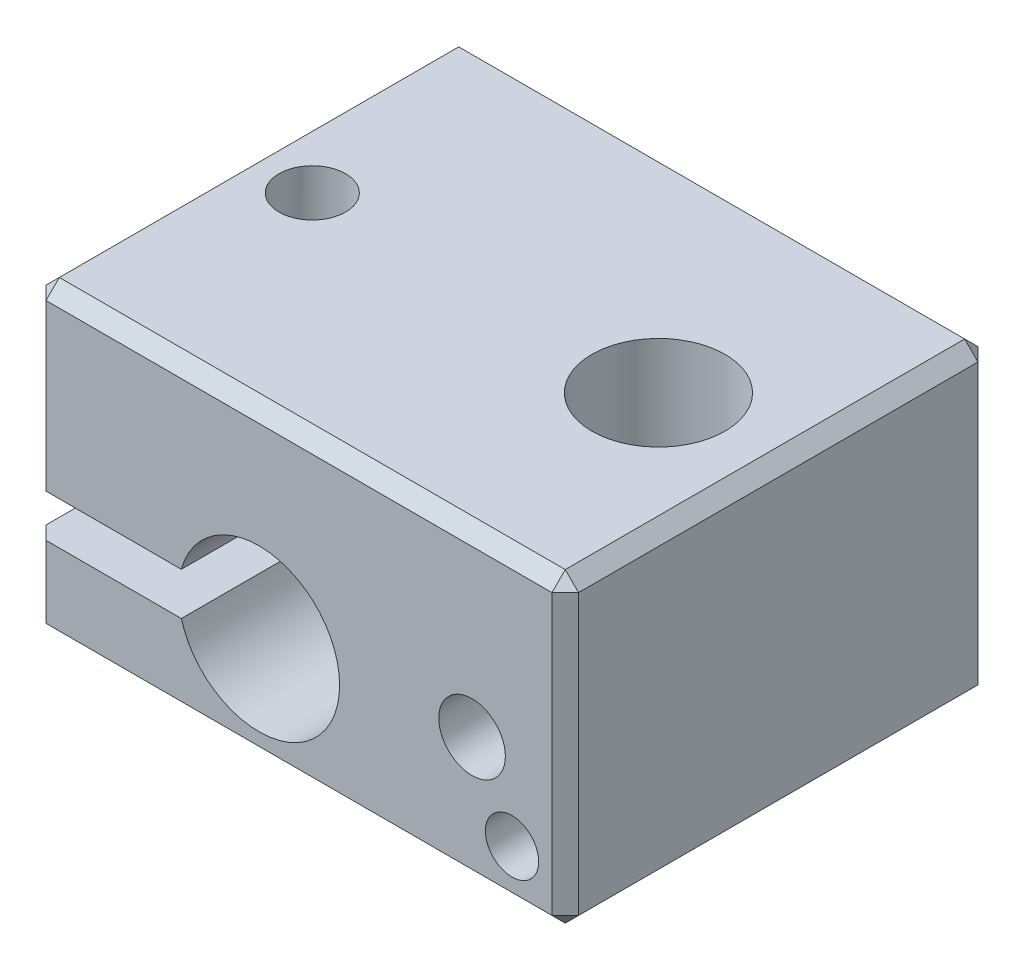
ISO-10303-21;
HEADER;
FILE_DESCRIPTION(('STEP AP214'),'2;1');
FILE_NAME('part.step','',(''),(''),'','','');
FILE_SCHEMA(('AUTOMOTIVE_DESIGN { 1 0 10303 214 1 1 1 1 }'));
ENDSEC;
DATA;
#1=APPLICATION_CONTEXT('core data for automotive mechanical design processes');
#2=APPLICATION_PROTOCOL_DEFINITION('international standard','automotive_design',2000,#1);
#3=PRODUCT_CONTEXT('',#1,'mechanical');
#4=PRODUCT('Part','Part','',(#3));
#5=PRODUCT_RELATED_PRODUCT_CATEGORY('part','',(#4));
#6=PRODUCT_DEFINITION_FORMATION('','',#4);
#7=PRODUCT_DEFINITION_CONTEXT('part definition',#1,'design');
#8=PRODUCT_DEFINITION('design','',#6,#7);
#9=PRODUCT_DEFINITION_SHAPE('','',#8);
#10=(LENGTH_UNIT() NAMED_UNIT(*) SI_UNIT(.MILLI.,.METRE.));
#11=(NAMED_UNIT(*) PLANE_ANGLE_UNIT() SI_UNIT($,.RADIAN.));
#12=(NAMED_UNIT(*) SI_UNIT($,.STERADIAN.) SOLID_ANGLE_UNIT());
#13=UNCERTAINTY_MEASURE_WITH_UNIT(LENGTH_MEASURE(1.E-05),#10,'distance_accuracy_value','');
#14=(GEOMETRIC_REPRESENTATION_CONTEXT(3) GLOBAL_UNCERTAINTY_ASSIGNED_CONTEXT((#13)) GLOBAL_UNIT_ASSIGNED_CONTEXT((#10,
#11,#12)) REPRESENTATION_CONTEXT('',''));
#15=CARTESIAN_POINT('',(0.,0.,0.));
#16=DIRECTION('',(0.,0.,1.));
#17=DIRECTION('',(1.,0.,0.));
#18=AXIS2_PLACEMENT_3D('',#15,#16,#17);
#19=CARTESIAN_POINT('',(-107.580280401954,-72.9503333027545,16.));
#20=DIRECTION('',(1.,0.,0.));
#21=DIRECTION('',(0.,1.,0.));
#22=AXIS2_PLACEMENT_3D('',#19,#20,#21);
#23=PLANE('',#22);
#24=DIRECTION('',(0.,0.,-1.));
#25=VECTOR('',#24,1.);
#26=CARTESIAN_POINT('',(-107.580280401954,-79.6503333027545,16.));
#27=LINE('',#26,#25);
#28=CARTESIAN_POINT('',(-107.580280401954,-79.6503333027545,15.5));
#29=VERTEX_POINT('',#28);
#30=CARTESIAN_POINT('',(-107.580280401954,-79.6503333027545,0.500000000000005));
#31=VERTEX_POINT('',#30);
#32=EDGE_CURVE('E206',#29,#31,#27,.T.);
#33=ORIENTED_EDGE('',*,*,#32,.F.);
#34=DIRECTION('',(0.,1.,0.));
#35=VECTOR('',#34,1.);
#36=CARTESIAN_POINT('',(-107.580280401954,-72.9503333027545,15.5));
#37=LINE('',#36,#35);
#38=CARTESIAN_POINT('',(-107.580280401954,-73.4503333027545,15.5));
#39=VERTEX_POINT('',#38);
#40=EDGE_CURVE('E214',#29,#39,#37,.T.);
#41=ORIENTED_EDGE('',*,*,#40,.T.);
#42=DIRECTION('',(0.,0.,-1.));
#43=VECTOR('',#42,1.);
#44=CARTESIAN_POINT('',(-107.580280401954,-73.4503333027545,16.));
#45=LINE('',#44,#43);
#46=CARTESIAN_POINT('',(-107.580280401954,-73.4503333027545,0.5));
#47=VERTEX_POINT('',#46);
#48=EDGE_CURVE('E211',#39,#47,#45,.T.);
#49=ORIENTED_EDGE('',*,*,#48,.T.);
#50=DIRECTION('',(0.,-1.,0.));
#51=VECTOR('',#50,1.);
#52=CARTESIAN_POINT('',(-107.580280401954,-72.9503333027545,0.5));
#53=LINE('',#52,#51);
#54=EDGE_CURVE('E209',#47,#31,#53,.T.);
#55=ORIENTED_EDGE('',*,*,#54,.T.);
#56=EDGE_LOOP('',(#33,#41,#49,#55));
#57=FACE_BOUND('',#56,.T.);
#58=ADVANCED_FACE('F37',(#57),#23,.F.);
#59=CARTESIAN_POINT('',(-107.580280401954,-79.6503333027545,16.));
#60=DIRECTION('',(0.,1.,0.));
#61=DIRECTION('',(-1.,0.,0.));
#62=AXIS2_PLACEMENT_3D('',#59,#60,#61);
#63=PLANE('',#62);
#64=CARTESIAN_POINT('',(-105.080280401954,-79.6503333027545,8.));
#65=DIRECTION('',(0.,1.,0.));
#66=DIRECTION('',(-1.,0.,0.));
#67=AXIS2_PLACEMENT_3D('',#64,#65,#66);
#68=CIRCLE('',#67,1.25);
#69=CARTESIAN_POINT('',(-106.330280401954,-79.6503333027545,8.));
#70=VERTEX_POINT('',#69);
#71=EDGE_CURVE('E356',#70,#70,#68,.T.);
#72=ORIENTED_EDGE('',*,*,#71,.T.);
#73=EDGE_LOOP('',(#72));
#74=FACE_BOUND('',#73,.T.);
#75=DIRECTION('',(1.,0.,0.));
#76=VECTOR('',#75,1.);
#77=CARTESIAN_POINT('',(-107.580280401954,-79.6503333027545,16.));
#78=LINE('',#77,#76);
#79=CARTESIAN_POINT('',(-107.080280401954,-79.6503333027545,16.));
#80=VERTEX_POINT('',#79);
#81=CARTESIAN_POINT('',(-101.99757795277,-79.6503333027545,16.));
#82=VERTEX_POINT('',#81);
#83=EDGE_CURVE('E186',#80,#82,#78,.T.);
#84=ORIENTED_EDGE('',*,*,#83,.F.);
#85=DIRECTION('',(-0.707106781186541,0.,-0.707106781186554));
#86=VECTOR('',#85,1.);
#87=CARTESIAN_POINT('',(-107.080280401954,-79.6503333027545,16.));
#88=LINE('',#87,#86);
#89=EDGE_CURVE('E247',#80,#29,#88,.T.);
#90=ORIENTED_EDGE('',*,*,#89,.T.);
#91=ORIENTED_EDGE('',*,*,#32,.T.);
#92=DIRECTION('',(-0.707106781186539,0.,0.707106781186556));
#93=VECTOR('',#92,1.);
#94=CARTESIAN_POINT('',(-107.580280401954,-79.6503333027545,0.500000000000002));
#95=LINE('',#94,#93);
#96=CARTESIAN_POINT('',(-107.080280401954,-79.6503333027545,0.));
#97=VERTEX_POINT('',#96);
#98=EDGE_CURVE('E245',#31,#97,#95,.F.);
#99=ORIENTED_EDGE('',*,*,#98,.T.);
#100=DIRECTION('',(1.,0.,0.));
#101=VECTOR('',#100,1.);
#102=CARTESIAN_POINT('',(-107.580280401954,-79.6503333027545,0.));
#103=LINE('',#102,#101);
#104=CARTESIAN_POINT('',(-101.99757795277,-79.6503333027545,0.));
#105=VERTEX_POINT('',#104);
#106=EDGE_CURVE('E176',#97,#105,#103,.T.);
#107=ORIENTED_EDGE('',*,*,#106,.T.);
#108=DIRECTION('',(0.,0.,-1.));
#109=VECTOR('',#108,1.);
#110=CARTESIAN_POINT('',(-101.99757795277,-79.6503333027545,16.));
#111=LINE('',#110,#109);
#112=EDGE_CURVE('E203',#82,#105,#111,.T.);
#113=ORIENTED_EDGE('',*,*,#112,.F.);
#114=EDGE_LOOP('',(#84,#90,#91,#99,#107,#113));
#115=FACE_BOUND('',#114,.T.);
#116=ADVANCED_FACE('F383',(#74,#115),#63,.F.);
#117=CARTESIAN_POINT('',(-99.0802804019537,-80.4503333027545,16.));
#118=DIRECTION('',(0.,0.,-1.));
#119=DIRECTION('',(-1.,0.,0.));
#120=AXIS2_PLACEMENT_3D('',#117,#118,#119);
#121=CYLINDRICAL_SURFACE('',#120,3.02499999999999);
#122=CARTESIAN_POINT('',(-99.0802804019537,-80.4503333027545,0.));
#123=DIRECTION('',(0.,0.,-1.));
#124=DIRECTION('',(1.,0.,0.));
#125=AXIS2_PLACEMENT_3D('',#122,#123,#124);
#126=CIRCLE('',#125,3.02499999999999);
#127=CARTESIAN_POINT('',(-101.99757795277,-81.2503333027545,0.));
#128=VERTEX_POINT('',#127);
#129=EDGE_CURVE('E179',#105,#128,#126,.T.);
#130=ORIENTED_EDGE('',*,*,#129,.T.);
#131=DIRECTION('',(0.,0.,-1.));
#132=VECTOR('',#131,1.);
#133=CARTESIAN_POINT('',(-101.99757795277,-81.2503333027545,16.));
#134=LINE('',#133,#132);
#135=CARTESIAN_POINT('',(-101.99757795277,-81.2503333027545,16.));
#136=VERTEX_POINT('',#135);
#137=EDGE_CURVE('E200',#136,#128,#134,.T.);
#138=ORIENTED_EDGE('',*,*,#137,.F.);
#139=CARTESIAN_POINT('',(-99.0802804019537,-80.4503333027545,16.));
#140=DIRECTION('',(0.,0.,-1.));
#141=DIRECTION('',(1.,0.,0.));
#142=AXIS2_PLACEMENT_3D('',#139,#140,#141);
#143=CIRCLE('',#142,3.02499999999999);
#144=EDGE_CURVE('E188',#82,#136,#143,.T.);
#145=ORIENTED_EDGE('',*,*,#144,.F.);
#146=ORIENTED_EDGE('',*,*,#112,.T.);
#147=EDGE_LOOP('',(#130,#138,#145,#146));
#148=FACE_BOUND('',#147,.T.);
#149=ADVANCED_FACE('F389',(#148),#121,.F.);
#150=CARTESIAN_POINT('',(-107.580280401954,-81.2503333027545,16.));
#151=DIRECTION('',(0.,-1.,0.));
#152=DIRECTION('',(1.,0.,0.));
#153=AXIS2_PLACEMENT_3D('',#150,#151,#152);
#154=PLANE('',#153);
#155=CARTESIAN_POINT('',(-105.080280401954,-81.2503333027545,8.));
#156=DIRECTION('',(0.,-1.,0.));
#157=DIRECTION('',(1.,0.,0.));
#158=AXIS2_PLACEMENT_3D('',#155,#156,#157);
#159=CIRCLE('',#158,1.6);
#160=CARTESIAN_POINT('',(-103.480280401954,-81.2503333027545,8.));
#161=VERTEX_POINT('',#160);
#162=EDGE_CURVE('E580',#161,#161,#159,.T.);
#163=ORIENTED_EDGE('',*,*,#162,.T.);
#164=EDGE_LOOP('',(#163));
#165=FACE_BOUND('',#164,.T.);
#166=DIRECTION('',(0.,0.,-1.));
#167=VECTOR('',#166,1.);
#168=CARTESIAN_POINT('',(-107.580280401954,-81.2503333027545,16.));
#169=LINE('',#168,#167);
#170=CARTESIAN_POINT('',(-107.580280401954,-81.2503333027545,15.5));
#171=VERTEX_POINT('',#170);
#172=CARTESIAN_POINT('',(-107.580280401954,-81.2503333027545,0.500000000000006));
#173=VERTEX_POINT('',#172);
#174=EDGE_CURVE('E193',#171,#173,#169,.T.);
#175=ORIENTED_EDGE('',*,*,#174,.F.);
#176=DIRECTION('',(0.70710678118655,0.,0.707106781186545));
#177=VECTOR('',#176,1.);
#178=CARTESIAN_POINT('',(-107.080280401954,-81.2503333027545,16.));
#179=LINE('',#178,#177);
#180=CARTESIAN_POINT('',(-107.080280401954,-81.2503333027545,16.));
#181=VERTEX_POINT('',#180);
#182=EDGE_CURVE('E243',#171,#181,#179,.T.);
#183=ORIENTED_EDGE('',*,*,#182,.T.);
#184=DIRECTION('',(-1.,0.,0.));
#185=VECTOR('',#184,1.);
#186=CARTESIAN_POINT('',(-107.580280401954,-81.2503333027545,16.));
#187=LINE('',#186,#185);
#188=EDGE_CURVE('E191',#136,#181,#187,.T.);
#189=ORIENTED_EDGE('',*,*,#188,.F.);
#190=ORIENTED_EDGE('',*,*,#137,.T.);
#191=DIRECTION('',(-1.,0.,0.));
#192=VECTOR('',#191,1.);
#193=CARTESIAN_POINT('',(-107.580280401954,-81.2503333027545,0.));
#194=LINE('',#193,#192);
#195=CARTESIAN_POINT('',(-107.080280401954,-81.2503333027545,0.));
#196=VERTEX_POINT('',#195);
#197=EDGE_CURVE('E189',#128,#196,#194,.T.);
#198=ORIENTED_EDGE('',*,*,#197,.T.);
#199=DIRECTION('',(0.707106781186548,0.,-0.707106781186548));
#200=VECTOR('',#199,1.);
#201=CARTESIAN_POINT('',(-107.580280401954,-81.2503333027545,0.5));
#202=LINE('',#201,#200);
#203=EDGE_CURVE('E241',#196,#173,#202,.F.);
#204=ORIENTED_EDGE('',*,*,#203,.T.);
#205=EDGE_LOOP('',(#175,#183,#189,#190,#198,#204));
#206=FACE_BOUND('',#205,.T.);
#207=ADVANCED_FACE('F487',(#165,#206),#154,.F.);
#208=CARTESIAN_POINT('',(-107.580280401954,-81.2503333027545,16.));
#209=DIRECTION('',(1.,0.,0.));
#210=DIRECTION('',(0.,0.,-1.));
#211=AXIS2_PLACEMENT_3D('',#208,#209,#210);
#212=PLANE('',#211);
#213=DIRECTION('',(0.,0.,1.));
#214=VECTOR('',#213,1.);
#215=CARTESIAN_POINT('',(-107.580280401954,-83.9503333027545,16.));
#216=LINE('',#215,#214);
#217=CARTESIAN_POINT('',(-107.580280401954,-83.9503333027545,0.5));
#218=VERTEX_POINT('',#217);
#219=CARTESIAN_POINT('',(-107.580280401954,-83.9503333027545,15.5));
#220=VERTEX_POINT('',#219);
#221=EDGE_CURVE('E237',#218,#220,#216,.T.);
#222=ORIENTED_EDGE('',*,*,#221,.T.);
#223=DIRECTION('',(0.,1.,0.));
#224=VECTOR('',#223,1.);
#225=CARTESIAN_POINT('',(-107.580280401954,-81.2503333027545,15.5));
#226=LINE('',#225,#224);
#227=EDGE_CURVE('E239',#220,#171,#226,.T.);
#228=ORIENTED_EDGE('',*,*,#227,.T.);
#229=ORIENTED_EDGE('',*,*,#174,.T.);
#230=DIRECTION('',(0.,-1.,0.));
#231=VECTOR('',#230,1.);
#232=CARTESIAN_POINT('',(-107.580280401954,-81.2503333027545,0.5));
#233=LINE('',#232,#231);
#234=EDGE_CURVE('E235',#173,#218,#233,.T.);
#235=ORIENTED_EDGE('',*,*,#234,.T.);
#236=EDGE_LOOP('',(#222,#228,#229,#235));
#237=FACE_BOUND('',#236,.T.);
#238=ADVANCED_FACE('F491',(#237),#212,.F.);
#239=CARTESIAN_POINT('',(-107.580280401954,-84.4503333027545,16.));
#240=DIRECTION('',(0.,1.,0.));
#241=DIRECTION('',(0.,0.,1.));
#242=AXIS2_PLACEMENT_3D('',#239,#240,#241);
#243=PLANE('',#242);
#244=CARTESIAN_POINT('',(-105.080280401954,-84.4503333027545,8.));
#245=DIRECTION('',(0.,-1.,0.));
#246=DIRECTION('',(0.,0.,-1.));
#247=AXIS2_PLACEMENT_3D('',#244,#245,#246);
#248=CIRCLE('',#247,1.6);
#249=CARTESIAN_POINT('',(-105.080280401954,-84.4503333027545,6.4));
#250=VERTEX_POINT('',#249);
#251=EDGE_CURVE('E583',#250,#250,#248,.T.);
#252=ORIENTED_EDGE('',*,*,#251,.F.);
#253=EDGE_LOOP('',(#252));
#254=FACE_BOUND('',#253,.T.);
#255=DIRECTION('',(-1.,0.,0.));
#256=VECTOR('',#255,1.);
#257=CARTESIAN_POINT('',(-107.580280401954,-84.4503333027545,15.5));
#258=LINE('',#257,#256);
#259=CARTESIAN_POINT('',(-88.0802804019537,-84.4503333027545,15.5));
#260=VERTEX_POINT('',#259);
#261=CARTESIAN_POINT('',(-107.080280401954,-84.4503333027545,15.5));
#262=VERTEX_POINT('',#261);
#263=EDGE_CURVE('E249',#260,#262,#258,.T.);
#264=ORIENTED_EDGE('',*,*,#263,.T.);
#265=DIRECTION('',(0.,0.,-1.));
#266=VECTOR('',#265,1.);
#267=CARTESIAN_POINT('',(-107.080280401954,-84.4503333027545,16.));
#268=LINE('',#267,#266);
#269=CARTESIAN_POINT('',(-107.080280401954,-84.4503333027545,0.5));
#270=VERTEX_POINT('',#269);
#271=EDGE_CURVE('E255',#262,#270,#268,.T.);
#272=ORIENTED_EDGE('',*,*,#271,.T.);
#273=DIRECTION('',(1.,0.,0.));
#274=VECTOR('',#273,1.);
#275=CARTESIAN_POINT('',(-107.580280401954,-84.4503333027545,0.5));
#276=LINE('',#275,#274);
#277=CARTESIAN_POINT('',(-88.0802804019537,-84.4503333027545,0.5));
#278=VERTEX_POINT('',#277);
#279=EDGE_CURVE('E253',#270,#278,#276,.T.);
#280=ORIENTED_EDGE('',*,*,#279,.T.);
#281=DIRECTION('',(0.,0.,1.));
#282=VECTOR('',#281,1.);
#283=CARTESIAN_POINT('',(-88.0802804019537,-84.4503333027545,16.));
#284=LINE('',#283,#282);
#285=EDGE_CURVE('E251',#278,#260,#284,.T.);
#286=ORIENTED_EDGE('',*,*,#285,.T.);
#287=EDGE_LOOP('',(#264,#272,#280,#286));
#288=FACE_BOUND('',#287,.T.);
#289=CARTESIAN_POINT('',(-92.0802804019537,-84.4503333027545,8.));
#290=DIRECTION('',(0.,1.,0.));
#291=DIRECTION('',(0.,0.,1.));
#292=AXIS2_PLACEMENT_3D('',#289,#290,#291);
#293=CIRCLE('',#292,2.5);
#294=CARTESIAN_POINT('',(-92.0802804019537,-84.4503333027545,10.5));
#295=VERTEX_POINT('',#294);
#296=EDGE_CURVE('E343',#295,#295,#293,.T.);
#297=ORIENTED_EDGE('',*,*,#296,.T.);
#298=EDGE_LOOP('',(#297));
#299=FACE_BOUND('',#298,.T.);
#300=ADVANCED_FACE('F600',(#254,#288,#299),#243,.F.);
#301=CARTESIAN_POINT('',(-87.5802804019537,-72.9503333027545,16.));
#302=DIRECTION('',(-1.,0.,0.));
#303=DIRECTION('',(0.,0.,1.));
#304=AXIS2_PLACEMENT_3D('',#301,#302,#303);
#305=PLANE('',#304);
#306=DIRECTION('',(0.,0.,-1.));
#307=VECTOR('',#306,1.);
#308=CARTESIAN_POINT('',(-87.5802804019537,-83.9503333027545,16.));
#309=LINE('',#308,#307);
#310=CARTESIAN_POINT('',(-87.5802804019537,-83.9503333027545,15.5));
#311=VERTEX_POINT('',#310);
#312=CARTESIAN_POINT('',(-87.5802804019537,-83.9503333027545,0.5));
#313=VERTEX_POINT('',#312);
#314=EDGE_CURVE('E46',#311,#313,#309,.T.);
#315=ORIENTED_EDGE('',*,*,#314,.T.);
#316=DIRECTION('',(0.,1.,0.));
#317=VECTOR('',#316,1.);
#318=CARTESIAN_POINT('',(-87.5802804019537,-72.9503333027545,0.5));
#319=LINE('',#318,#317);
#320=CARTESIAN_POINT('',(-87.5802804019537,-73.4503333027545,0.5));
#321=VERTEX_POINT('',#320);
#322=EDGE_CURVE('E11',#313,#321,#319,.T.);
#323=ORIENTED_EDGE('',*,*,#322,.T.);
#324=DIRECTION('',(0.,0.,1.));
#325=VECTOR('',#324,1.);
#326=CARTESIAN_POINT('',(-87.5802804019537,-73.4503333027545,16.));
#327=LINE('',#326,#325);
#328=CARTESIAN_POINT('',(-87.5802804019537,-73.4503333027545,15.5));
#329=VERTEX_POINT('',#328);
#330=EDGE_CURVE('E270',#321,#329,#327,.T.);
#331=ORIENTED_EDGE('',*,*,#330,.T.);
#332=DIRECTION('',(0.,-1.,0.));
#333=VECTOR('',#332,1.);
#334=CARTESIAN_POINT('',(-87.5802804019537,-84.4503333027545,15.5));
#335=LINE('',#334,#333);
#336=EDGE_CURVE('E268',#329,#311,#335,.T.);
#337=ORIENTED_EDGE('',*,*,#336,.T.);
#338=EDGE_LOOP('',(#315,#323,#331,#337));
#339=FACE_BOUND('',#338,.T.);
#340=ADVANCED_FACE('F518',(#339),#305,.F.);
#341=CARTESIAN_POINT('',(-107.580280401954,-72.9503333027545,16.));
#342=DIRECTION('',(0.,-1.,0.));
#343=DIRECTION('',(0.,0.,-1.));
#344=AXIS2_PLACEMENT_3D('',#341,#342,#343);
#345=PLANE('',#344);
#346=DIRECTION('',(-1.,0.,0.));
#347=VECTOR('',#346,1.);
#348=CARTESIAN_POINT('',(-107.580280401954,-72.9503333027545,0.499999999999997));
#349=LINE('',#348,#347);
#350=CARTESIAN_POINT('',(-88.0802804019537,-72.9503333027545,0.499999999999997));
#351=VERTEX_POINT('',#350);
#352=CARTESIAN_POINT('',(-107.080280401954,-72.9503333027545,0.499999999999997));
#353=VERTEX_POINT('',#352);
#354=EDGE_CURVE('E220',#351,#353,#349,.T.);
#355=ORIENTED_EDGE('',*,*,#354,.T.);
#356=DIRECTION('',(0.,0.,1.));
#357=VECTOR('',#356,1.);
#358=CARTESIAN_POINT('',(-107.080280401954,-72.9503333027545,16.));
#359=LINE('',#358,#357);
#360=CARTESIAN_POINT('',(-107.080280401954,-72.9503333027545,15.5));
#361=VERTEX_POINT('',#360);
#362=EDGE_CURVE('E222',#353,#361,#359,.T.);
#363=ORIENTED_EDGE('',*,*,#362,.T.);
#364=DIRECTION('',(1.,0.,0.));
#365=VECTOR('',#364,1.);
#366=CARTESIAN_POINT('',(-87.5802804019537,-72.9503333027545,15.5));
#367=LINE('',#366,#365);
#368=CARTESIAN_POINT('',(-88.0802804019537,-72.9503333027545,15.5));
#369=VERTEX_POINT('',#368);
#370=EDGE_CURVE('E216',#361,#369,#367,.T.);
#371=ORIENTED_EDGE('',*,*,#370,.T.);
#372=DIRECTION('',(0.,0.,-1.));
#373=VECTOR('',#372,1.);
#374=CARTESIAN_POINT('',(-88.0802804019537,-72.9503333027545,16.));
#375=LINE('',#374,#373);
#376=EDGE_CURVE('E218',#369,#351,#375,.T.);
#377=ORIENTED_EDGE('',*,*,#376,.T.);
#378=EDGE_LOOP('',(#355,#363,#371,#377));
#379=FACE_BOUND('',#378,.T.);
#380=CARTESIAN_POINT('',(-92.0802804019537,-72.9503333027545,8.));
#381=DIRECTION('',(0.,1.,0.));
#382=DIRECTION('',(0.,0.,1.));
#383=AXIS2_PLACEMENT_3D('',#380,#381,#382);
#384=CIRCLE('',#383,2.5);
#385=CARTESIAN_POINT('',(-92.0802804019537,-72.9503333027545,10.5));
#386=VERTEX_POINT('',#385);
#387=EDGE_CURVE('E338',#386,#386,#384,.T.);
#388=ORIENTED_EDGE('',*,*,#387,.F.);
#389=EDGE_LOOP('',(#388));
#390=FACE_BOUND('',#389,.T.);
#391=CARTESIAN_POINT('',(-105.080280401954,-72.9503333027545,8.));
#392=DIRECTION('',(0.,1.,0.));
#393=DIRECTION('',(0.,0.,1.));
#394=AXIS2_PLACEMENT_3D('',#391,#392,#393);
#395=CIRCLE('',#394,1.25);
#396=CARTESIAN_POINT('',(-105.080280401954,-72.9503333027545,9.25));
#397=VERTEX_POINT('',#396);
#398=EDGE_CURVE('E348',#397,#397,#395,.T.);
#399=ORIENTED_EDGE('',*,*,#398,.F.);
#400=EDGE_LOOP('',(#399));
#401=FACE_BOUND('',#400,.T.);
#402=ADVANCED_FACE('F369',(#379,#390,#401),#345,.F.);
#403=CARTESIAN_POINT('',(-99.0802804019537,-80.4503333027545,16.));
#404=DIRECTION('',(0.,0.,1.));
#405=DIRECTION('',(1.,0.,0.));
#406=AXIS2_PLACEMENT_3D('',#403,#404,#405);
#407=PLANE('',#406);
#408=ORIENTED_EDGE('',*,*,#188,.T.);
#409=DIRECTION('',(0.,-1.,0.));
#410=VECTOR('',#409,1.);
#411=CARTESIAN_POINT('',(-107.080280401954,-84.4503333027545,16.));
#412=LINE('',#411,#410);
#413=CARTESIAN_POINT('',(-107.080280401954,-83.9503333027545,16.));
#414=VERTEX_POINT('',#413);
#415=EDGE_CURVE('E233',#181,#414,#412,.T.);
#416=ORIENTED_EDGE('',*,*,#415,.T.);
#417=DIRECTION('',(1.,0.,0.));
#418=VECTOR('',#417,1.);
#419=CARTESIAN_POINT('',(-87.5802804019537,-83.9503333027545,16.));
#420=LINE('',#419,#418);
#421=CARTESIAN_POINT('',(-88.0802804019537,-83.9503333027545,16.));
#422=VERTEX_POINT('',#421);
#423=EDGE_CURVE('E229',#414,#422,#420,.T.);
#424=ORIENTED_EDGE('',*,*,#423,.T.);
#425=DIRECTION('',(0.,1.,0.));
#426=VECTOR('',#425,1.);
#427=CARTESIAN_POINT('',(-88.0802804019537,-72.9503333027545,16.));
#428=LINE('',#427,#426);
#429=CARTESIAN_POINT('',(-88.0802804019537,-73.4503333027545,16.));
#430=VERTEX_POINT('',#429);
#431=EDGE_CURVE('E227',#422,#430,#428,.T.);
#432=ORIENTED_EDGE('',*,*,#431,.T.);
#433=DIRECTION('',(-1.,0.,0.));
#434=VECTOR('',#433,1.);
#435=CARTESIAN_POINT('',(-107.580280401954,-73.4503333027545,16.));
#436=LINE('',#435,#434);
#437=CARTESIAN_POINT('',(-107.080280401954,-73.4503333027545,16.));
#438=VERTEX_POINT('',#437);
#439=EDGE_CURVE('E225',#430,#438,#436,.T.);
#440=ORIENTED_EDGE('',*,*,#439,.T.);
#441=DIRECTION('',(0.,-1.,0.));
#442=VECTOR('',#441,1.);
#443=CARTESIAN_POINT('',(-107.080280401954,-79.6503333027545,16.));
#444=LINE('',#443,#442);
#445=EDGE_CURVE('E231',#438,#80,#444,.T.);
#446=ORIENTED_EDGE('',*,*,#445,.T.);
#447=ORIENTED_EDGE('',*,*,#83,.T.);
#448=ORIENTED_EDGE('',*,*,#144,.T.);
#449=EDGE_LOOP('',(#408,#416,#424,#432,#440,#446,#447,#448));
#450=FACE_BOUND('',#449,.T.);
#451=CARTESIAN_POINT('',(-89.5802804019537,-82.4503333027545,16.));
#452=DIRECTION('',(0.,0.,1.));
#453=DIRECTION('',(1.,0.,0.));
#454=AXIS2_PLACEMENT_3D('',#451,#452,#453);
#455=CIRCLE('',#454,0.999999999999998);
#456=CARTESIAN_POINT('',(-88.5802804019537,-82.4503333027545,16.));
#457=VERTEX_POINT('',#456);
#458=EDGE_CURVE('E359',#457,#457,#455,.T.);
#459=ORIENTED_EDGE('',*,*,#458,.F.);
#460=EDGE_LOOP('',(#459));
#461=FACE_BOUND('',#460,.T.);
#462=CARTESIAN_POINT('',(-91.0802804019537,-79.6503333027545,16.));
#463=DIRECTION('',(0.,0.,1.));
#464=DIRECTION('',(1.,0.,0.));
#465=AXIS2_PLACEMENT_3D('',#462,#463,#464);
#466=CIRCLE('',#465,1.25);
#467=CARTESIAN_POINT('',(-89.8302804019537,-79.6503333027545,16.));
#468=VERTEX_POINT('',#467);
#469=EDGE_CURVE('E177',#468,#468,#466,.T.);
#470=ORIENTED_EDGE('',*,*,#469,.F.);
#471=EDGE_LOOP('',(#470));
#472=FACE_BOUND('',#471,.T.);
#473=ADVANCED_FACE('F366',(#450,#461,#472),#407,.T.);
#474=CARTESIAN_POINT('',(-99.0802804019537,-80.4503333027545,0.));
#475=DIRECTION('',(0.,0.,1.));
#476=DIRECTION('',(1.,0.,0.));
#477=AXIS2_PLACEMENT_3D('',#474,#475,#476);
#478=PLANE('',#477);
#479=DIRECTION('',(-1.,0.,0.));
#480=VECTOR('',#479,1.);
#481=CARTESIAN_POINT('',(-99.0802804019537,-83.9503333027545,0.));
#482=LINE('',#481,#480);
#483=CARTESIAN_POINT('',(-88.0802804019537,-83.9503333027545,0.));
#484=VERTEX_POINT('',#483);
#485=CARTESIAN_POINT('',(-107.080280401954,-83.9503333027545,0.));
#486=VERTEX_POINT('',#485);
#487=EDGE_CURVE('E262',#484,#486,#482,.T.);
#488=ORIENTED_EDGE('',*,*,#487,.T.);
#489=DIRECTION('',(0.,1.,0.));
#490=VECTOR('',#489,1.);
#491=CARTESIAN_POINT('',(-107.080280401954,-80.4503333027545,0.));
#492=LINE('',#491,#490);
#493=EDGE_CURVE('E266',#486,#196,#492,.T.);
#494=ORIENTED_EDGE('',*,*,#493,.T.);
#495=ORIENTED_EDGE('',*,*,#197,.F.);
#496=ORIENTED_EDGE('',*,*,#129,.F.);
#497=ORIENTED_EDGE('',*,*,#106,.F.);
#498=DIRECTION('',(0.,1.,0.));
#499=VECTOR('',#498,1.);
#500=CARTESIAN_POINT('',(-107.080280401954,-80.4503333027545,0.));
#501=LINE('',#500,#499);
#502=CARTESIAN_POINT('',(-107.080280401954,-73.4503333027545,0.));
#503=VERTEX_POINT('',#502);
#504=EDGE_CURVE('E264',#97,#503,#501,.T.);
#505=ORIENTED_EDGE('',*,*,#504,.T.);
#506=DIRECTION('',(1.,0.,0.));
#507=VECTOR('',#506,1.);
#508=CARTESIAN_POINT('',(-99.0802804019537,-73.4503333027545,0.));
#509=LINE('',#508,#507);
#510=CARTESIAN_POINT('',(-88.0802804019537,-73.4503333027545,0.));
#511=VERTEX_POINT('',#510);
#512=EDGE_CURVE('E260',#503,#511,#509,.T.);
#513=ORIENTED_EDGE('',*,*,#512,.T.);
#514=DIRECTION('',(0.,-1.,0.));
#515=VECTOR('',#514,1.);
#516=CARTESIAN_POINT('',(-88.0802804019537,-80.4503333027545,0.));
#517=LINE('',#516,#515);
#518=EDGE_CURVE('E258',#511,#484,#517,.T.);
#519=ORIENTED_EDGE('',*,*,#518,.T.);
#520=EDGE_LOOP('',(#488,#494,#495,#496,#497,#505,#513,#519));
#521=FACE_BOUND('',#520,.T.);
#522=ADVANCED_FACE('F170',(#521),#478,.F.);
#523=CARTESIAN_POINT('',(-91.0802804019537,-79.6503333027545,12.5));
#524=DIRECTION('',(0.,0.,1.));
#525=DIRECTION('',(1.,0.,0.));
#526=AXIS2_PLACEMENT_3D('',#523,#524,#525);
#527=CONICAL_SURFACE('',#526,1.25,1.02974425867666);
#528=CARTESIAN_POINT('',(-91.0802804019537,-79.6503333027545,11.7489242262155));
#529=VERTEX_POINT('',#528);
#530=VERTEX_LOOP('',#529);
#531=FACE_BOUND('',#530,.T.);
#532=CARTESIAN_POINT('',(-91.0802804019537,-79.6503333027545,12.5));
#533=DIRECTION('',(0.,0.,1.));
#534=DIRECTION('',(1.,0.,0.));
#535=AXIS2_PLACEMENT_3D('',#532,#533,#534);
#536=CIRCLE('',#535,1.25);
#537=CARTESIAN_POINT('',(-89.8302804019537,-79.6503333027545,12.5));
#538=VERTEX_POINT('',#537);
#539=EDGE_CURVE('E174',#538,#538,#536,.T.);
#540=ORIENTED_EDGE('',*,*,#539,.T.);
#541=EDGE_LOOP('',(#540));
#542=FACE_BOUND('',#541,.T.);
#543=ADVANCED_FACE('F166',(#531,#542),#527,.F.);
#544=CARTESIAN_POINT('',(-91.0802804019537,-79.6503333027545,16.));
#545=DIRECTION('',(0.,0.,1.));
#546=DIRECTION('',(1.,0.,0.));
#547=AXIS2_PLACEMENT_3D('',#544,#545,#546);
#548=CYLINDRICAL_SURFACE('',#547,1.25);
#549=ORIENTED_EDGE('',*,*,#539,.F.);
#550=EDGE_LOOP('',(#549));
#551=FACE_BOUND('',#550,.T.);
#552=ORIENTED_EDGE('',*,*,#469,.T.);
#553=EDGE_LOOP('',(#552));
#554=FACE_BOUND('',#553,.T.);
#555=ADVANCED_FACE('F169',(#551,#554),#548,.F.);
#556=CARTESIAN_POINT('',(-89.5802804019537,-82.4503333027545,14.));
#557=DIRECTION('',(0.,0.,1.));
#558=DIRECTION('',(1.,0.,0.));
#559=AXIS2_PLACEMENT_3D('',#556,#557,#558);
#560=CYLINDRICAL_SURFACE('',#559,0.999999999999998);
#561=CARTESIAN_POINT('',(-89.5802804019537,-82.4503333027545,14.));
#562=DIRECTION('',(0.,0.,1.));
#563=DIRECTION('',(1.,0.,0.));
#564=AXIS2_PLACEMENT_3D('',#561,#562,#563);
#565=CIRCLE('',#564,0.999999999999998);
#566=CARTESIAN_POINT('',(-88.5802804019537,-82.4503333027545,14.));
#567=VERTEX_POINT('',#566);
#568=EDGE_CURVE('E182',#567,#567,#565,.T.);
#569=ORIENTED_EDGE('',*,*,#568,.F.);
#570=EDGE_LOOP('',(#569));
#571=FACE_BOUND('',#570,.T.);
#572=ORIENTED_EDGE('',*,*,#458,.T.);
#573=EDGE_LOOP('',(#572));
#574=FACE_BOUND('',#573,.T.);
#575=ADVANCED_FACE('F364',(#571,#574),#560,.F.);
#576=CARTESIAN_POINT('',(-89.5802804019537,-82.4503333027545,14.));
#577=DIRECTION('',(0.,0.,1.));
#578=DIRECTION('',(1.,0.,0.));
#579=AXIS2_PLACEMENT_3D('',#576,#577,#578);
#580=PLANE('',#579);
#581=CARTESIAN_POINT('',(-89.5802804019537,-82.4503333027545,14.));
#582=DIRECTION('',(0.,0.,1.));
#583=DIRECTION('',(1.,0.,0.));
#584=AXIS2_PLACEMENT_3D('',#581,#582,#583);
#585=CIRCLE('',#584,0.799999999999994);
#586=CARTESIAN_POINT('',(-88.7802804019537,-82.4503333027545,14.));
#587=VERTEX_POINT('',#586);
#588=EDGE_CURVE('E41',#587,#587,#585,.T.);
#589=ORIENTED_EDGE('',*,*,#588,.F.);
#590=EDGE_LOOP('',(#589));
#591=FACE_BOUND('',#590,.T.);
#592=ORIENTED_EDGE('',*,*,#568,.T.);
#593=EDGE_LOOP('',(#592));
#594=FACE_BOUND('',#593,.T.);
#595=ADVANCED_FACE('F379',(#591,#594),#580,.T.);
#596=CARTESIAN_POINT('',(-105.080280401954,-72.9503333027545,8.));
#597=DIRECTION('',(0.,1.,0.));
#598=DIRECTION('',(0.,0.,1.));
#599=AXIS2_PLACEMENT_3D('',#596,#597,#598);
#600=CYLINDRICAL_SURFACE('',#599,1.25);
#601=ORIENTED_EDGE('',*,*,#71,.F.);
#602=EDGE_LOOP('',(#601));
#603=FACE_BOUND('',#602,.T.);
#604=ORIENTED_EDGE('',*,*,#398,.T.);
#605=EDGE_LOOP('',(#604));
#606=FACE_BOUND('',#605,.T.);
#607=ADVANCED_FACE('F551',(#603,#606),#600,.F.);
#608=CARTESIAN_POINT('',(-92.0802804019537,-72.9503333027545,8.));
#609=DIRECTION('',(0.,1.,0.));
#610=DIRECTION('',(0.,0.,1.));
#611=AXIS2_PLACEMENT_3D('',#608,#609,#610);
#612=CYLINDRICAL_SURFACE('',#611,2.5);
#613=ORIENTED_EDGE('',*,*,#296,.F.);
#614=EDGE_LOOP('',(#613));
#615=FACE_BOUND('',#614,.T.);
#616=ORIENTED_EDGE('',*,*,#387,.T.);
#617=EDGE_LOOP('',(#616));
#618=FACE_BOUND('',#617,.T.);
#619=ADVANCED_FACE('F479',(#615,#618),#612,.F.);
#620=CARTESIAN_POINT('',(-107.080280401954,-80.4503333027545,16.));
#621=DIRECTION('',(-0.707106781186545,0.,0.70710678118655));
#622=DIRECTION('',(0.,1.,0.));
#623=AXIS2_PLACEMENT_3D('',#620,#621,#622);
#624=PLANE('',#623);
#625=ORIENTED_EDGE('',*,*,#182,.F.);
#626=ORIENTED_EDGE('',*,*,#227,.F.);
#627=DIRECTION('',(-0.70710678118655,0.,-0.707106781186545));
#628=VECTOR('',#627,1.);
#629=CARTESIAN_POINT('',(-107.080280401954,-83.9503333027545,16.));
#630=LINE('',#629,#628);
#631=EDGE_CURVE('E334',#414,#220,#630,.T.);
#632=ORIENTED_EDGE('',*,*,#631,.F.);
#633=ORIENTED_EDGE('',*,*,#415,.F.);
#634=EDGE_LOOP('',(#625,#626,#632,#633));
#635=FACE_BOUND('',#634,.T.);
#636=ADVANCED_FACE('F39',(#635),#624,.T.);
#637=CARTESIAN_POINT('',(-107.580280401954,-81.2503333027545,0.5));
#638=DIRECTION('',(0.707106781186547,0.,0.707106781186547));
#639=DIRECTION('',(0.,-1.,0.));
#640=AXIS2_PLACEMENT_3D('',#637,#638,#639);
#641=PLANE('',#640);
#642=ORIENTED_EDGE('',*,*,#203,.F.);
#643=ORIENTED_EDGE('',*,*,#493,.F.);
#644=DIRECTION('',(-0.707106781186547,0.,0.707106781186547));
#645=VECTOR('',#644,1.);
#646=CARTESIAN_POINT('',(-107.330280401954,-83.9503333027545,0.25));
#647=LINE('',#646,#645);
#648=EDGE_CURVE('E331',#218,#486,#647,.F.);
#649=ORIENTED_EDGE('',*,*,#648,.F.);
#650=ORIENTED_EDGE('',*,*,#234,.F.);
#651=EDGE_LOOP('',(#642,#643,#649,#650));
#652=FACE_BOUND('',#651,.T.);
#653=ADVANCED_FACE('F472',(#652),#641,.F.);
#654=CARTESIAN_POINT('',(-107.080280401954,-84.4503333027545,16.));
#655=DIRECTION('',(0.707106781186547,0.707106781186547,0.));
#656=DIRECTION('',(0.,0.,-1.));
#657=AXIS2_PLACEMENT_3D('',#654,#655,#656);
#658=PLANE('',#657);
#659=DIRECTION('',(-0.707106781186547,0.707106781186547,0.));
#660=VECTOR('',#659,1.);
#661=CARTESIAN_POINT('',(-107.330280401954,-84.2003333027545,15.5));
#662=LINE('',#661,#660);
#663=EDGE_CURVE('E336',#220,#262,#662,.F.);
#664=ORIENTED_EDGE('',*,*,#663,.F.);
#665=ORIENTED_EDGE('',*,*,#221,.F.);
#666=DIRECTION('',(0.707106781186547,-0.707106781186547,0.));
#667=VECTOR('',#666,1.);
#668=CARTESIAN_POINT('',(-107.080280401954,-84.4503333027545,0.5));
#669=LINE('',#668,#667);
#670=EDGE_CURVE('E328',#270,#218,#669,.F.);
#671=ORIENTED_EDGE('',*,*,#670,.F.);
#672=ORIENTED_EDGE('',*,*,#271,.F.);
#673=EDGE_LOOP('',(#664,#665,#671,#672));
#674=FACE_BOUND('',#673,.T.);
#675=ADVANCED_FACE('F470',(#674),#658,.F.);
#676=CARTESIAN_POINT('',(-107.080280401954,-83.9503333027545,16.));
#677=DIRECTION('',(-0.577350269189624,-0.577350269189624,0.577350269189628));
#678=DIRECTION('',(0.70710678118655,0.,0.707106781186545));
#679=AXIS2_PLACEMENT_3D('',#676,#677,#678);
#680=PLANE('',#679);
#681=ORIENTED_EDGE('',*,*,#631,.T.);
#682=ORIENTED_EDGE('',*,*,#663,.T.);
#683=DIRECTION('',(0.,0.70710678118655,0.707106781186545));
#684=VECTOR('',#683,1.);
#685=CARTESIAN_POINT('',(-107.080280401954,-83.9503333027545,16.));
#686=LINE('',#685,#684);
#687=EDGE_CURVE('E325',#414,#262,#686,.F.);
#688=ORIENTED_EDGE('',*,*,#687,.F.);
#689=EDGE_LOOP('',(#681,#682,#688));
#690=FACE_BOUND('',#689,.T.);
#691=ADVANCED_FACE('F466',(#690),#680,.T.);
#692=CARTESIAN_POINT('',(-107.080280401954,-84.4503333027545,0.5));
#693=DIRECTION('',(-0.577350269189626,-0.577350269189626,-0.577350269189626));
#694=DIRECTION('',(-0.707106781186547,0.,0.707106781186547));
#695=AXIS2_PLACEMENT_3D('',#692,#693,#694);
#696=PLANE('',#695);
#697=ORIENTED_EDGE('',*,*,#670,.T.);
#698=ORIENTED_EDGE('',*,*,#648,.T.);
#699=DIRECTION('',(0.,0.707106781186547,-0.707106781186547));
#700=VECTOR('',#699,1.);
#701=CARTESIAN_POINT('',(-107.080280401954,-84.4503333027545,0.5));
#702=LINE('',#701,#700);
#703=EDGE_CURVE('E322',#270,#486,#702,.T.);
#704=ORIENTED_EDGE('',*,*,#703,.F.);
#705=EDGE_LOOP('',(#697,#698,#704));
#706=FACE_BOUND('',#705,.T.);
#707=ADVANCED_FACE('F462',(#706),#696,.T.);
#708=CARTESIAN_POINT('',(-99.0802804019537,-83.9503333027545,16.));
#709=DIRECTION('',(0.,-0.707106781186545,0.70710678118655));
#710=DIRECTION('',(-1.,0.,0.));
#711=AXIS2_PLACEMENT_3D('',#708,#709,#710);
#712=PLANE('',#711);
#713=ORIENTED_EDGE('',*,*,#687,.T.);
#714=ORIENTED_EDGE('',*,*,#263,.F.);
#715=DIRECTION('',(0.,-0.70710678118655,-0.707106781186545));
#716=VECTOR('',#715,1.);
#717=CARTESIAN_POINT('',(-88.0802804019537,-84.4503333027545,15.5));
#718=LINE('',#717,#716);
#719=EDGE_CURVE('E316',#422,#260,#718,.T.);
#720=ORIENTED_EDGE('',*,*,#719,.F.);
#721=ORIENTED_EDGE('',*,*,#423,.F.);
#722=EDGE_LOOP('',(#713,#714,#720,#721));
#723=FACE_BOUND('',#722,.T.);
#724=ADVANCED_FACE('F458',(#723),#712,.T.);
#725=CARTESIAN_POINT('',(-107.580280401954,-84.4503333027545,0.5));
#726=DIRECTION('',(0.,0.707106781186547,0.707106781186547));
#727=DIRECTION('',(1.,0.,0.));
#728=AXIS2_PLACEMENT_3D('',#725,#726,#727);
#729=PLANE('',#728);
#730=ORIENTED_EDGE('',*,*,#703,.T.);
#731=ORIENTED_EDGE('',*,*,#487,.F.);
#732=DIRECTION('',(0.,-0.707106781186547,0.707106781186547));
#733=VECTOR('',#732,1.);
#734=CARTESIAN_POINT('',(-88.0802804019537,-84.4503333027545,0.5));
#735=LINE('',#734,#733);
#736=EDGE_CURVE('E313',#278,#484,#735,.F.);
#737=ORIENTED_EDGE('',*,*,#736,.F.);
#738=ORIENTED_EDGE('',*,*,#279,.F.);
#739=EDGE_LOOP('',(#730,#731,#737,#738));
#740=FACE_BOUND('',#739,.T.);
#741=ADVANCED_FACE('F454',(#740),#729,.F.);
#742=CARTESIAN_POINT('',(-87.5802804019537,-83.9503333027545,16.));
#743=DIRECTION('',(-0.707106781186547,0.707106781186547,0.));
#744=DIRECTION('',(0.,0.,-1.));
#745=AXIS2_PLACEMENT_3D('',#742,#743,#744);
#746=PLANE('',#745);
#747=DIRECTION('',(-0.707106781186547,-0.707106781186547,0.));
#748=VECTOR('',#747,1.);
#749=CARTESIAN_POINT('',(-88.0802804019537,-84.4503333027545,15.5));
#750=LINE('',#749,#748);
#751=EDGE_CURVE('E319',#260,#311,#750,.F.);
#752=ORIENTED_EDGE('',*,*,#751,.F.);
#753=ORIENTED_EDGE('',*,*,#285,.F.);
#754=DIRECTION('',(0.707106781186547,0.707106781186547,0.));
#755=VECTOR('',#754,1.);
#756=CARTESIAN_POINT('',(-88.0802804019537,-84.4503333027545,0.5));
#757=LINE('',#756,#755);
#758=EDGE_CURVE('E310',#313,#278,#757,.F.);
#759=ORIENTED_EDGE('',*,*,#758,.F.);
#760=ORIENTED_EDGE('',*,*,#314,.F.);
#761=EDGE_LOOP('',(#752,#753,#759,#760));
#762=FACE_BOUND('',#761,.T.);
#763=ADVANCED_FACE('F450',(#762),#746,.F.);
#764=CARTESIAN_POINT('',(-88.0802804019537,-84.4503333027545,15.5));
#765=DIRECTION('',(0.577350269189624,-0.577350269189624,0.577350269189628));
#766=DIRECTION('',(0.70710678118655,0.,-0.707106781186545));
#767=AXIS2_PLACEMENT_3D('',#764,#765,#766);
#768=PLANE('',#767);
#769=ORIENTED_EDGE('',*,*,#719,.T.);
#770=ORIENTED_EDGE('',*,*,#751,.T.);
#771=DIRECTION('',(-0.70710678118655,0.,0.707106781186545));
#772=VECTOR('',#771,1.);
#773=CARTESIAN_POINT('',(-87.8302804019537,-83.9503333027545,15.75));
#774=LINE('',#773,#772);
#775=EDGE_CURVE('E307',#422,#311,#774,.F.);
#776=ORIENTED_EDGE('',*,*,#775,.F.);
#777=EDGE_LOOP('',(#769,#770,#776));
#778=FACE_BOUND('',#777,.T.);
#779=ADVANCED_FACE('F446',(#778),#768,.T.);
#780=CARTESIAN_POINT('',(-88.0802804019537,-84.4503333027545,0.5));
#781=DIRECTION('',(0.577350269189626,-0.577350269189626,-0.577350269189626));
#782=DIRECTION('',(-0.707106781186547,0.,-0.707106781186547));
#783=AXIS2_PLACEMENT_3D('',#780,#781,#782);
#784=PLANE('',#783);
#785=ORIENTED_EDGE('',*,*,#758,.T.);
#786=ORIENTED_EDGE('',*,*,#736,.T.);
#787=DIRECTION('',(-0.707106781186547,0.,-0.707106781186547));
#788=VECTOR('',#787,1.);
#789=CARTESIAN_POINT('',(-87.8302804019537,-83.9503333027545,0.25));
#790=LINE('',#789,#788);
#791=EDGE_CURVE('E304',#313,#484,#790,.T.);
#792=ORIENTED_EDGE('',*,*,#791,.F.);
#793=EDGE_LOOP('',(#785,#786,#792));
#794=FACE_BOUND('',#793,.T.);
#795=ADVANCED_FACE('F442',(#794),#784,.T.);
#796=CARTESIAN_POINT('',(-88.0802804019537,-80.4503333027545,16.));
#797=DIRECTION('',(0.707106781186545,0.,0.70710678118655));
#798=DIRECTION('',(0.,-1.,0.));
#799=AXIS2_PLACEMENT_3D('',#796,#797,#798);
#800=PLANE('',#799);
#801=ORIENTED_EDGE('',*,*,#775,.T.);
#802=ORIENTED_EDGE('',*,*,#336,.F.);
#803=DIRECTION('',(0.70710678118655,0.,-0.707106781186545));
#804=VECTOR('',#803,1.);
#805=CARTESIAN_POINT('',(-87.5802804019537,-73.4503333027545,15.5));
#806=LINE('',#805,#804);
#807=EDGE_CURVE('E298',#430,#329,#806,.T.);
#808=ORIENTED_EDGE('',*,*,#807,.F.);
#809=ORIENTED_EDGE('',*,*,#431,.F.);
#810=EDGE_LOOP('',(#801,#802,#808,#809));
#811=FACE_BOUND('',#810,.T.);
#812=ADVANCED_FACE('F438',(#811),#800,.T.);
#813=CARTESIAN_POINT('',(-87.5802804019537,-72.9503333027545,0.5));
#814=DIRECTION('',(-0.707106781186547,0.,0.707106781186547));
#815=DIRECTION('',(0.,1.,0.));
#816=AXIS2_PLACEMENT_3D('',#813,#814,#815);
#817=PLANE('',#816);
#818=ORIENTED_EDGE('',*,*,#791,.T.);
#819=ORIENTED_EDGE('',*,*,#518,.F.);
#820=DIRECTION('',(0.707106781186548,0.,0.707106781186548));
#821=VECTOR('',#820,1.);
#822=CARTESIAN_POINT('',(-88.0802804019537,-73.4503333027545,0.));
#823=LINE('',#822,#821);
#824=EDGE_CURVE('E296',#321,#511,#823,.F.);
#825=ORIENTED_EDGE('',*,*,#824,.F.);
#826=ORIENTED_EDGE('',*,*,#322,.F.);
#827=EDGE_LOOP('',(#818,#819,#825,#826));
#828=FACE_BOUND('',#827,.T.);
#829=ADVANCED_FACE('F434',(#828),#817,.F.);
#830=CARTESIAN_POINT('',(-88.0802804019537,-72.9503333027545,16.));
#831=DIRECTION('',(-0.707106781186547,-0.707106781186547,0.));
#832=DIRECTION('',(0.,0.,-1.));
#833=AXIS2_PLACEMENT_3D('',#830,#831,#832);
#834=PLANE('',#833);
#835=DIRECTION('',(0.707106781186547,-0.707106781186547,0.));
#836=VECTOR('',#835,1.);
#837=CARTESIAN_POINT('',(-87.5802804019537,-73.4503333027545,15.5));
#838=LINE('',#837,#836);
#839=EDGE_CURVE('E301',#329,#369,#838,.F.);
#840=ORIENTED_EDGE('',*,*,#839,.F.);
#841=ORIENTED_EDGE('',*,*,#330,.F.);
#842=DIRECTION('',(-0.707106781186548,0.707106781186548,0.));
#843=VECTOR('',#842,1.);
#844=CARTESIAN_POINT('',(-87.8302804019537,-73.2003333027545,0.499999999999999));
#845=LINE('',#844,#843);
#846=EDGE_CURVE('E60',#351,#321,#845,.F.);
#847=ORIENTED_EDGE('',*,*,#846,.F.);
#848=ORIENTED_EDGE('',*,*,#376,.F.);
#849=EDGE_LOOP('',(#840,#841,#847,#848));
#850=FACE_BOUND('',#849,.T.);
#851=ADVANCED_FACE('F430',(#850),#834,.F.);
#852=CARTESIAN_POINT('',(-87.5802804019537,-73.4503333027545,15.5));
#853=DIRECTION('',(0.577350269189624,0.577350269189624,0.577350269189628));
#854=DIRECTION('',(0.70710678118655,0.,-0.707106781186545));
#855=AXIS2_PLACEMENT_3D('',#852,#853,#854);
#856=PLANE('',#855);
#857=ORIENTED_EDGE('',*,*,#807,.T.);
#858=ORIENTED_EDGE('',*,*,#839,.T.);
#859=DIRECTION('',(0.,-0.70710678118655,0.707106781186545));
#860=VECTOR('',#859,1.);
#861=CARTESIAN_POINT('',(-88.0802804019537,-73.2003333027545,15.75));
#862=LINE('',#861,#860);
#863=EDGE_CURVE('E292',#430,#369,#862,.F.);
#864=ORIENTED_EDGE('',*,*,#863,.F.);
#865=EDGE_LOOP('',(#857,#858,#864));
#866=FACE_BOUND('',#865,.T.);
#867=ADVANCED_FACE('F427',(#866),#856,.T.);
#868=CARTESIAN_POINT('',(-88.0802804019537,-73.4503333027545,0.));
#869=DIRECTION('',(0.577350269189627,0.577350269189623,-0.577350269189627));
#870=DIRECTION('',(-0.707106781186547,0.,-0.707106781186547));
#871=AXIS2_PLACEMENT_3D('',#868,#869,#870);
#872=PLANE('',#871);
#873=ORIENTED_EDGE('',*,*,#846,.T.);
#874=ORIENTED_EDGE('',*,*,#824,.T.);
#875=DIRECTION('',(0.,-0.70710678118655,-0.707106781186545));
#876=VECTOR('',#875,1.);
#877=CARTESIAN_POINT('',(-88.0802804019537,-73.4503333027545,0.));
#878=LINE('',#877,#876);
#879=EDGE_CURVE('E289',#351,#511,#878,.T.);
#880=ORIENTED_EDGE('',*,*,#879,.F.);
#881=EDGE_LOOP('',(#873,#874,#880));
#882=FACE_BOUND('',#881,.T.);
#883=ADVANCED_FACE('F423',(#882),#872,.T.);
#884=CARTESIAN_POINT('',(-99.0802804019537,-73.4503333027545,16.));
#885=DIRECTION('',(0.,0.707106781186545,0.70710678118655));
#886=DIRECTION('',(1.,0.,0.));
#887=AXIS2_PLACEMENT_3D('',#884,#885,#886);
#888=PLANE('',#887);
#889=ORIENTED_EDGE('',*,*,#863,.T.);
#890=ORIENTED_EDGE('',*,*,#370,.F.);
#891=DIRECTION('',(0.,0.70710678118655,-0.707106781186545));
#892=VECTOR('',#891,1.);
#893=CARTESIAN_POINT('',(-107.080280401954,-72.9503333027545,15.5));
#894=LINE('',#893,#892);
#895=EDGE_CURVE('E286',#438,#361,#894,.T.);
#896=ORIENTED_EDGE('',*,*,#895,.F.);
#897=ORIENTED_EDGE('',*,*,#439,.F.);
#898=EDGE_LOOP('',(#889,#890,#896,#897));
#899=FACE_BOUND('',#898,.T.);
#900=ADVANCED_FACE('F419',(#899),#888,.T.);
#901=CARTESIAN_POINT('',(-107.080280401954,-80.4503333027545,16.));
#902=DIRECTION('',(-0.707106781186554,0.,0.707106781186541));
#903=DIRECTION('',(0.,1.,0.));
#904=AXIS2_PLACEMENT_3D('',#901,#902,#903);
#905=PLANE('',#904);
#906=ORIENTED_EDGE('',*,*,#89,.F.);
#907=ORIENTED_EDGE('',*,*,#445,.F.);
#908=DIRECTION('',(0.707106781186541,0.,0.707106781186554));
#909=VECTOR('',#908,1.);
#910=CARTESIAN_POINT('',(-107.330280401954,-73.4503333027545,15.75));
#911=LINE('',#910,#909);
#912=EDGE_CURVE('E283',#39,#438,#911,.T.);
#913=ORIENTED_EDGE('',*,*,#912,.F.);
#914=ORIENTED_EDGE('',*,*,#40,.F.);
#915=EDGE_LOOP('',(#906,#907,#913,#914));
#916=FACE_BOUND('',#915,.T.);
#917=ADVANCED_FACE('F415',(#916),#905,.T.);
#918=CARTESIAN_POINT('',(-107.580280401954,-72.9503333027545,0.5));
#919=DIRECTION('',(0.707106781186556,0.,0.707106781186539));
#920=DIRECTION('',(0.,-1.,0.));
#921=AXIS2_PLACEMENT_3D('',#918,#919,#920);
#922=PLANE('',#921);
#923=ORIENTED_EDGE('',*,*,#98,.F.);
#924=ORIENTED_EDGE('',*,*,#54,.F.);
#925=DIRECTION('',(0.707106781186539,0.,-0.707106781186556));
#926=VECTOR('',#925,1.);
#927=CARTESIAN_POINT('',(-107.580280401954,-73.4503333027545,0.5));
#928=LINE('',#927,#926);
#929=EDGE_CURVE('E280',#503,#47,#928,.F.);
#930=ORIENTED_EDGE('',*,*,#929,.F.);
#931=ORIENTED_EDGE('',*,*,#504,.F.);
#932=EDGE_LOOP('',(#923,#924,#930,#931));
#933=FACE_BOUND('',#932,.T.);
#934=ADVANCED_FACE('F411',(#933),#922,.F.);
#935=CARTESIAN_POINT('',(-107.580280401954,-72.9503333027545,0.499999999999997));
#936=DIRECTION('',(0.,-0.707106781186545,0.70710678118655));
#937=DIRECTION('',(-1.,0.,0.));
#938=AXIS2_PLACEMENT_3D('',#935,#936,#937);
#939=PLANE('',#938);
#940=ORIENTED_EDGE('',*,*,#879,.T.);
#941=ORIENTED_EDGE('',*,*,#512,.F.);
#942=DIRECTION('',(0.,0.70710678118655,0.707106781186545));
#943=VECTOR('',#942,1.);
#944=CARTESIAN_POINT('',(-107.080280401954,-73.2003333027545,0.249999999999992));
#945=LINE('',#944,#943);
#946=EDGE_CURVE('E277',#353,#503,#945,.F.);
#947=ORIENTED_EDGE('',*,*,#946,.F.);
#948=ORIENTED_EDGE('',*,*,#354,.F.);
#949=EDGE_LOOP('',(#940,#941,#947,#948));
#950=FACE_BOUND('',#949,.T.);
#951=ADVANCED_FACE('F407',(#950),#939,.F.);
#952=CARTESIAN_POINT('',(-107.080280401954,-72.9503333027545,15.5));
#953=DIRECTION('',(-0.57735026918963,0.57735026918963,0.577350269189618));
#954=DIRECTION('',(-0.707106781186547,-0.707106781186547,0.));
#955=AXIS2_PLACEMENT_3D('',#952,#953,#954);
#956=PLANE('',#955);
#957=ORIENTED_EDGE('',*,*,#912,.T.);
#958=ORIENTED_EDGE('',*,*,#895,.T.);
#959=DIRECTION('',(0.707106781186548,0.707106781186548,0.));
#960=VECTOR('',#959,1.);
#961=CARTESIAN_POINT('',(-107.080280401954,-72.9503333027545,15.5));
#962=LINE('',#961,#960);
#963=EDGE_CURVE('E275',#39,#361,#962,.T.);
#964=ORIENTED_EDGE('',*,*,#963,.F.);
#965=EDGE_LOOP('',(#957,#958,#964));
#966=FACE_BOUND('',#965,.T.);
#967=ADVANCED_FACE('F403',(#966),#956,.T.);
#968=CARTESIAN_POINT('',(-107.580280401954,-73.4503333027545,0.5));
#969=DIRECTION('',(-0.577350269189632,0.577350269189628,-0.577350269189616));
#970=DIRECTION('',(-0.707106781186545,-0.70710678118655,0.));
#971=AXIS2_PLACEMENT_3D('',#968,#969,#970);
#972=PLANE('',#971);
#973=ORIENTED_EDGE('',*,*,#946,.T.);
#974=ORIENTED_EDGE('',*,*,#929,.T.);
#975=DIRECTION('',(-0.707106781186548,-0.707106781186548,0.));
#976=VECTOR('',#975,1.);
#977=CARTESIAN_POINT('',(-107.580280401954,-73.4503333027545,0.5));
#978=LINE('',#977,#976);
#979=EDGE_CURVE('E273',#353,#47,#978,.T.);
#980=ORIENTED_EDGE('',*,*,#979,.F.);
#981=EDGE_LOOP('',(#973,#974,#980));
#982=FACE_BOUND('',#981,.T.);
#983=ADVANCED_FACE('F399',(#982),#972,.T.);
#984=CARTESIAN_POINT('',(-107.580280401954,-73.4503333027545,16.));
#985=DIRECTION('',(0.707106781186547,-0.707106781186547,0.));
#986=DIRECTION('',(0.,0.,-1.));
#987=AXIS2_PLACEMENT_3D('',#984,#985,#986);
#988=PLANE('',#987);
#989=ORIENTED_EDGE('',*,*,#963,.T.);
#990=ORIENTED_EDGE('',*,*,#362,.F.);
#991=ORIENTED_EDGE('',*,*,#979,.T.);
#992=ORIENTED_EDGE('',*,*,#48,.F.);
#993=EDGE_LOOP('',(#989,#990,#991,#992));
#994=FACE_BOUND('',#993,.T.);
#995=ADVANCED_FACE('F395',(#994),#988,.F.);
#996=CARTESIAN_POINT('',(-89.5802804019537,-82.4503333027545,11.5));
#997=DIRECTION('',(0.,0.,1.));
#998=DIRECTION('',(1.,0.,0.));
#999=AXIS2_PLACEMENT_3D('',#996,#997,#998);
#1000=CYLINDRICAL_SURFACE('',#999,0.799999999999994);
#1001=ORIENTED_EDGE('',*,*,#588,.T.);
#1002=EDGE_LOOP('',(#1001));
#1003=FACE_BOUND('',#1002,.T.);
#1004=CARTESIAN_POINT('',(-89.5802804019537,-82.4503333027545,11.5));
#1005=DIRECTION('',(0.,0.,1.));
#1006=DIRECTION('',(1.,0.,0.));
#1007=AXIS2_PLACEMENT_3D('',#1004,#1005,#1006);
#1008=CIRCLE('',#1007,0.799999999999994);
#1009=CARTESIAN_POINT('',(-88.7802804019537,-82.4503333027545,11.5));
#1010=VERTEX_POINT('',#1009);
#1011=EDGE_CURVE('E351',#1010,#1010,#1008,.T.);
#1012=ORIENTED_EDGE('',*,*,#1011,.F.);
#1013=EDGE_LOOP('',(#1012));
#1014=FACE_BOUND('',#1013,.T.);
#1015=ADVANCED_FACE('F398',(#1003,#1014),#1000,.F.);
#1016=CARTESIAN_POINT('',(-89.5802804019537,-82.4503333027545,11.5));
#1017=DIRECTION('',(0.,0.,1.));
#1018=DIRECTION('',(1.,0.,0.));
#1019=AXIS2_PLACEMENT_3D('',#1016,#1017,#1018);
#1020=PLANE('',#1019);
#1021=ORIENTED_EDGE('',*,*,#1011,.T.);
#1022=EDGE_LOOP('',(#1021));
#1023=FACE_BOUND('',#1022,.T.);
#1024=ADVANCED_FACE('F567',(#1023),#1020,.T.);
#1025=CARTESIAN_POINT('',(-105.080280401954,-84.4503333027545,8.));
#1026=DIRECTION('',(0.,-1.,0.));
#1027=DIRECTION('',(0.,0.,-1.));
#1028=AXIS2_PLACEMENT_3D('',#1025,#1026,#1027);
#1029=CYLINDRICAL_SURFACE('',#1028,1.6);
#1030=ORIENTED_EDGE('',*,*,#162,.F.);
#1031=EDGE_LOOP('',(#1030));
#1032=FACE_BOUND('',#1031,.T.);
#1033=ORIENTED_EDGE('',*,*,#251,.T.);
#1034=EDGE_LOOP('',(#1033));
#1035=FACE_BOUND('',#1034,.T.);
#1036=ADVANCED_FACE('F571',(#1032,#1035),#1029,.F.);
#1037=CLOSED_SHELL('',(#58,#116,#149,#207,#238,#300,#340,#402,#473,#522,#543,#555,#575,#595,
#607,#619,#636,#653,#675,#691,#707,#724,#741,#763,#779,#795,#812,#829,#851,#867,#883,#900,#917,
#934,#951,#967,#983,#995,#1015,#1024,#1036));
#1038=MANIFOLD_SOLID_BREP('B2',#1037);
#1039=ADVANCED_BREP_SHAPE_REPRESENTATION('',(#18,#1038),#14);
#1040=SHAPE_DEFINITION_REPRESENTATION(#9,#1039);
ENDSEC;
END-ISO-10303-21;
